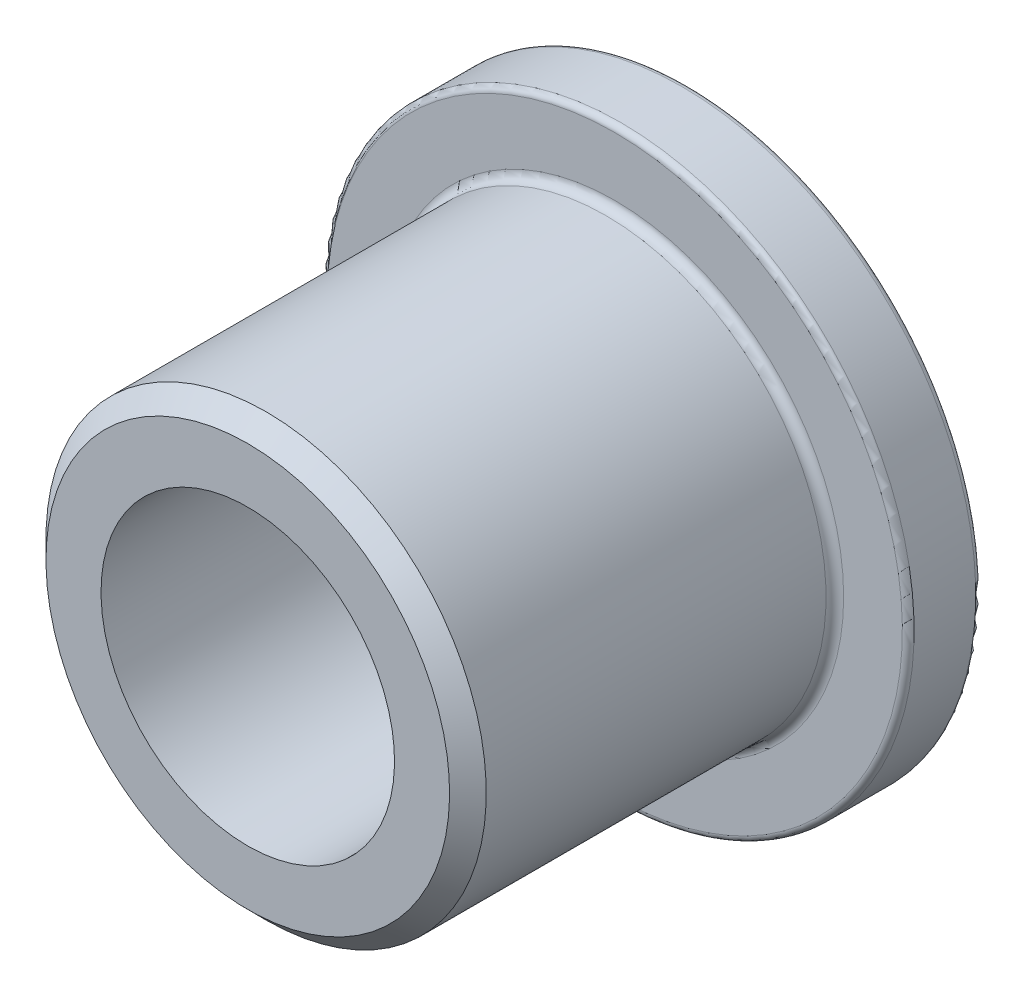
ISO-10303-21;
HEADER;
FILE_DESCRIPTION(('STEP AP214'),'2;1');
FILE_NAME('part.step','',(''),(''),'','','');
FILE_SCHEMA(('AUTOMOTIVE_DESIGN { 1 0 10303 214 1 1 1 1 }'));
ENDSEC;
DATA;
#1=APPLICATION_CONTEXT('core data for automotive mechanical design processes');
#2=APPLICATION_PROTOCOL_DEFINITION('international standard','automotive_design',2000,#1);
#3=PRODUCT_CONTEXT('',#1,'mechanical');
#4=PRODUCT('Part','Part','',(#3));
#5=PRODUCT_RELATED_PRODUCT_CATEGORY('part','',(#4));
#6=PRODUCT_DEFINITION_FORMATION('','',#4);
#7=PRODUCT_DEFINITION_CONTEXT('part definition',#1,'design');
#8=PRODUCT_DEFINITION('design','',#6,#7);
#9=PRODUCT_DEFINITION_SHAPE('','',#8);
#10=(LENGTH_UNIT() NAMED_UNIT(*) SI_UNIT(.MILLI.,.METRE.));
#11=(NAMED_UNIT(*) PLANE_ANGLE_UNIT() SI_UNIT($,.RADIAN.));
#12=(NAMED_UNIT(*) SI_UNIT($,.STERADIAN.) SOLID_ANGLE_UNIT());
#13=UNCERTAINTY_MEASURE_WITH_UNIT(LENGTH_MEASURE(1.E-05),#10,'distance_accuracy_value','');
#14=(GEOMETRIC_REPRESENTATION_CONTEXT(3) GLOBAL_UNCERTAINTY_ASSIGNED_CONTEXT((#13)) GLOBAL_UNIT_ASSIGNED_CONTEXT((#10,
#11,#12)) REPRESENTATION_CONTEXT('',''));
#15=CARTESIAN_POINT('',(0.,0.,0.));
#16=DIRECTION('',(0.,0.,1.));
#17=DIRECTION('',(1.,0.,0.));
#18=AXIS2_PLACEMENT_3D('',#15,#16,#17);
#19=CARTESIAN_POINT('',(0.,4.7625,4.7625));
#20=DIRECTION('',(0.,0.,-1.));
#21=DIRECTION('',(0.,1.,0.));
#22=AXIS2_PLACEMENT_3D('',#19,#20,#21);
#23=PLANE('',#22);
#24=CARTESIAN_POINT('',(0.,0.,4.7625));
#25=DIRECTION('',(0.,0.,-1.));
#26=DIRECTION('',(0.,1.,0.));
#27=AXIS2_PLACEMENT_3D('',#24,#25,#26);
#28=CIRCLE('',#27,4.365625);
#29=CARTESIAN_POINT('',(0.,4.365625,4.7625));
#30=VERTEX_POINT('',#29);
#31=EDGE_CURVE('E67',#30,#30,#28,.F.);
#32=ORIENTED_EDGE('',*,*,#31,.T.);
#33=EDGE_LOOP('',(#32));
#34=FACE_BOUND('',#33,.T.);
#35=CARTESIAN_POINT('',(0.,0.,4.7625));
#36=DIRECTION('',(0.,0.,1.));
#37=DIRECTION('',(0.,-1.,0.));
#38=AXIS2_PLACEMENT_3D('',#35,#36,#37);
#39=CIRCLE('',#38,3.175);
#40=CARTESIAN_POINT('',(0.,-3.175,4.7625));
#41=VERTEX_POINT('',#40);
#42=EDGE_CURVE('E70',#41,#41,#39,.T.);
#43=ORIENTED_EDGE('',*,*,#42,.F.);
#44=EDGE_LOOP('',(#43));
#45=FACE_BOUND('',#44,.T.);
#46=ADVANCED_FACE('F32',(#34,#45),#23,.F.);
#47=CARTESIAN_POINT('',(0.,0.,4.7625));
#48=DIRECTION('',(0.,0.,1.));
#49=DIRECTION('',(0.,-1.,0.));
#50=AXIS2_PLACEMENT_3D('',#47,#48,#49);
#51=CYLINDRICAL_SURFACE('',#50,3.175);
#52=CARTESIAN_POINT('',(0.,0.,-4.44499999999999));
#53=DIRECTION('',(0.,0.,1.));
#54=DIRECTION('',(0.,-1.,0.));
#55=AXIS2_PLACEMENT_3D('',#52,#53,#54);
#56=CIRCLE('',#55,3.175);
#57=CARTESIAN_POINT('',(0.,-3.175,-4.44499999999999));
#58=VERTEX_POINT('',#57);
#59=EDGE_CURVE('E10',#58,#58,#56,.F.);
#60=ORIENTED_EDGE('',*,*,#59,.T.);
#61=EDGE_LOOP('',(#60));
#62=FACE_BOUND('',#61,.T.);
#63=ORIENTED_EDGE('',*,*,#42,.T.);
#64=EDGE_LOOP('',(#63));
#65=FACE_BOUND('',#64,.T.);
#66=ADVANCED_FACE('F74',(#62,#65),#51,.F.);
#67=CARTESIAN_POINT('',(0.,3.175,-4.7625));
#68=DIRECTION('',(0.,0.,1.));
#69=DIRECTION('',(0.,-1.,0.));
#70=AXIS2_PLACEMENT_3D('',#67,#68,#69);
#71=PLANE('',#70);
#72=CARTESIAN_POINT('',(0.,0.,-4.7625));
#73=DIRECTION('',(0.,0.,1.));
#74=DIRECTION('',(0.,-1.,0.));
#75=AXIS2_PLACEMENT_3D('',#72,#73,#74);
#76=CIRCLE('',#75,3.4925);
#77=CARTESIAN_POINT('',(0.,-3.4925,-4.7625));
#78=VERTEX_POINT('',#77);
#79=EDGE_CURVE('E39',#78,#78,#76,.T.);
#80=ORIENTED_EDGE('',*,*,#79,.T.);
#81=EDGE_LOOP('',(#80));
#82=FACE_BOUND('',#81,.T.);
#83=CARTESIAN_POINT('',(0.,0.,-4.7625));
#84=DIRECTION('',(0.,0.,1.));
#85=DIRECTION('',(0.,-1.,0.));
#86=AXIS2_PLACEMENT_3D('',#83,#84,#85);
#87=CIRCLE('',#86,6.223);
#88=CARTESIAN_POINT('',(0.,-6.223,-4.7625));
#89=VERTEX_POINT('',#88);
#90=EDGE_CURVE('E47',#89,#89,#87,.F.);
#91=ORIENTED_EDGE('',*,*,#90,.T.);
#92=EDGE_LOOP('',(#91));
#93=FACE_BOUND('',#92,.T.);
#94=ADVANCED_FACE('F82',(#82,#93),#71,.F.);
#95=CARTESIAN_POINT('',(0.,0.,4.7625));
#96=DIRECTION('',(0.,0.,1.));
#97=DIRECTION('',(0.,-1.,0.));
#98=AXIS2_PLACEMENT_3D('',#95,#96,#97);
#99=CYLINDRICAL_SURFACE('',#98,6.35);
#100=CARTESIAN_POINT('',(0.,0.,-4.6355));
#101=DIRECTION('',(0.,0.,1.));
#102=DIRECTION('',(0.,-1.,0.));
#103=AXIS2_PLACEMENT_3D('',#100,#101,#102);
#104=CIRCLE('',#103,6.35);
#105=CARTESIAN_POINT('',(0.,-6.35,-4.6355));
#106=VERTEX_POINT('',#105);
#107=EDGE_CURVE('E52',#106,#106,#104,.T.);
#108=ORIENTED_EDGE('',*,*,#107,.T.);
#109=EDGE_LOOP('',(#108));
#110=FACE_BOUND('',#109,.T.);
#111=CARTESIAN_POINT('',(0.,0.,-3.302));
#112=DIRECTION('',(0.,0.,-1.));
#113=DIRECTION('',(0.,1.,0.));
#114=AXIS2_PLACEMENT_3D('',#111,#112,#113);
#115=CIRCLE('',#114,6.35);
#116=CARTESIAN_POINT('',(0.,6.35,-3.302));
#117=VERTEX_POINT('',#116);
#118=EDGE_CURVE('E55',#117,#117,#115,.T.);
#119=ORIENTED_EDGE('',*,*,#118,.T.);
#120=EDGE_LOOP('',(#119));
#121=FACE_BOUND('',#120,.T.);
#122=ADVANCED_FACE('F112',(#110,#121),#99,.T.);
#123=CARTESIAN_POINT('',(0.,6.35,-3.175));
#124=DIRECTION('',(0.,0.,-1.));
#125=DIRECTION('',(0.,1.,0.));
#126=AXIS2_PLACEMENT_3D('',#123,#124,#125);
#127=PLANE('',#126);
#128=CARTESIAN_POINT('',(0.,0.,-3.175));
#129=DIRECTION('',(0.,0.,-1.));
#130=DIRECTION('',(0.,1.,0.));
#131=AXIS2_PLACEMENT_3D('',#128,#129,#130);
#132=CIRCLE('',#131,6.223);
#133=CARTESIAN_POINT('',(0.,6.223,-3.175));
#134=VERTEX_POINT('',#133);
#135=EDGE_CURVE('E43',#134,#134,#132,.F.);
#136=ORIENTED_EDGE('',*,*,#135,.T.);
#137=EDGE_LOOP('',(#136));
#138=FACE_BOUND('',#137,.T.);
#139=CARTESIAN_POINT('',(0.,0.,-3.175));
#140=DIRECTION('',(0.,0.,-1.));
#141=DIRECTION('',(0.,1.,0.));
#142=AXIS2_PLACEMENT_3D('',#139,#140,#141);
#143=CIRCLE('',#142,4.953);
#144=CARTESIAN_POINT('',(0.,4.953,-3.175));
#145=VERTEX_POINT('',#144);
#146=EDGE_CURVE('E58',#145,#145,#143,.T.);
#147=ORIENTED_EDGE('',*,*,#146,.T.);
#148=EDGE_LOOP('',(#147));
#149=FACE_BOUND('',#148,.T.);
#150=ADVANCED_FACE('F109',(#138,#149),#127,.F.);
#151=CARTESIAN_POINT('',(0.,0.,4.7625));
#152=DIRECTION('',(0.,0.,1.));
#153=DIRECTION('',(0.,-1.,0.));
#154=AXIS2_PLACEMENT_3D('',#151,#152,#153);
#155=CYLINDRICAL_SURFACE('',#154,4.7625);
#156=CARTESIAN_POINT('',(0.,0.,-2.9845));
#157=DIRECTION('',(0.,0.,-1.));
#158=DIRECTION('',(0.,1.,0.));
#159=AXIS2_PLACEMENT_3D('',#156,#157,#158);
#160=CIRCLE('',#159,4.7625);
#161=CARTESIAN_POINT('',(0.,4.7625,-2.9845));
#162=VERTEX_POINT('',#161);
#163=EDGE_CURVE('E61',#162,#162,#160,.F.);
#164=ORIENTED_EDGE('',*,*,#163,.T.);
#165=EDGE_LOOP('',(#164));
#166=FACE_BOUND('',#165,.T.);
#167=CARTESIAN_POINT('',(0.,0.,4.365625));
#168=DIRECTION('',(0.,0.,-1.));
#169=DIRECTION('',(0.,1.,0.));
#170=AXIS2_PLACEMENT_3D('',#167,#168,#169);
#171=CIRCLE('',#170,4.7625);
#172=CARTESIAN_POINT('',(0.,4.7625,4.365625));
#173=VERTEX_POINT('',#172);
#174=EDGE_CURVE('E64',#173,#173,#171,.T.);
#175=ORIENTED_EDGE('',*,*,#174,.T.);
#176=EDGE_LOOP('',(#175));
#177=FACE_BOUND('',#176,.T.);
#178=ADVANCED_FACE('F90',(#166,#177),#155,.T.);
#179=CARTESIAN_POINT('',(0.,0.,4.7625));
#180=DIRECTION('',(0.,0.,-1.));
#181=DIRECTION('',(0.,1.,0.));
#182=AXIS2_PLACEMENT_3D('',#179,#180,#181);
#183=CONICAL_SURFACE('',#182,4.365625,0.785398163397446);
#184=ORIENTED_EDGE('',*,*,#174,.F.);
#185=EDGE_LOOP('',(#184));
#186=FACE_BOUND('',#185,.T.);
#187=ORIENTED_EDGE('',*,*,#31,.F.);
#188=EDGE_LOOP('',(#187));
#189=FACE_BOUND('',#188,.T.);
#190=ADVANCED_FACE('F86',(#186,#189),#183,.T.);
#191=CARTESIAN_POINT('',(0.,0.,-2.9845));
#192=DIRECTION('',(0.,0.,-1.));
#193=DIRECTION('',(0.,1.,0.));
#194=AXIS2_PLACEMENT_3D('',#191,#192,#193);
#195=TOROIDAL_SURFACE('',#194,4.953,0.1905);
#196=ORIENTED_EDGE('',*,*,#146,.F.);
#197=EDGE_LOOP('',(#196));
#198=FACE_BOUND('',#197,.T.);
#199=ORIENTED_EDGE('',*,*,#163,.F.);
#200=EDGE_LOOP('',(#199));
#201=FACE_BOUND('',#200,.T.);
#202=ADVANCED_FACE('F89',(#198,#201),#195,.F.);
#203=CARTESIAN_POINT('',(0.,0.,-4.6355));
#204=DIRECTION('',(0.,0.,1.));
#205=DIRECTION('',(0.,-1.,0.));
#206=AXIS2_PLACEMENT_3D('',#203,#204,#205);
#207=TOROIDAL_SURFACE('',#206,6.223,0.127);
#208=ORIENTED_EDGE('',*,*,#90,.F.);
#209=EDGE_LOOP('',(#208));
#210=FACE_BOUND('',#209,.T.);
#211=ORIENTED_EDGE('',*,*,#107,.F.);
#212=EDGE_LOOP('',(#211));
#213=FACE_BOUND('',#212,.T.);
#214=ADVANCED_FACE('F94',(#210,#213),#207,.T.);
#215=CARTESIAN_POINT('',(0.,0.,-3.302));
#216=DIRECTION('',(0.,0.,-1.));
#217=DIRECTION('',(0.,1.,0.));
#218=AXIS2_PLACEMENT_3D('',#215,#216,#217);
#219=TOROIDAL_SURFACE('',#218,6.223,0.127);
#220=ORIENTED_EDGE('',*,*,#118,.F.);
#221=EDGE_LOOP('',(#220));
#222=FACE_BOUND('',#221,.T.);
#223=ORIENTED_EDGE('',*,*,#135,.F.);
#224=EDGE_LOOP('',(#223));
#225=FACE_BOUND('',#224,.T.);
#226=ADVANCED_FACE('F97',(#222,#225),#219,.T.);
#227=CARTESIAN_POINT('',(0.,0.,-4.7625));
#228=DIRECTION('',(0.,0.,-1.));
#229=DIRECTION('',(0.,1.,0.));
#230=AXIS2_PLACEMENT_3D('',#227,#228,#229);
#231=CONICAL_SURFACE('',#230,3.4925,0.785398163397448);
#232=ORIENTED_EDGE('',*,*,#59,.F.);
#233=EDGE_LOOP('',(#232));
#234=FACE_BOUND('',#233,.T.);
#235=ORIENTED_EDGE('',*,*,#79,.F.);
#236=EDGE_LOOP('',(#235));
#237=FACE_BOUND('',#236,.T.);
#238=ADVANCED_FACE('F34',(#234,#237),#231,.F.);
#239=CLOSED_SHELL('',(#46,#66,#94,#122,#150,#178,#190,#202,#214,#226,#238));
#240=MANIFOLD_SOLID_BREP('B2',#239);
#241=ADVANCED_BREP_SHAPE_REPRESENTATION('',(#18,#240),#14);
#242=SHAPE_DEFINITION_REPRESENTATION(#9,#241);
ENDSEC;
END-ISO-10303-21;
